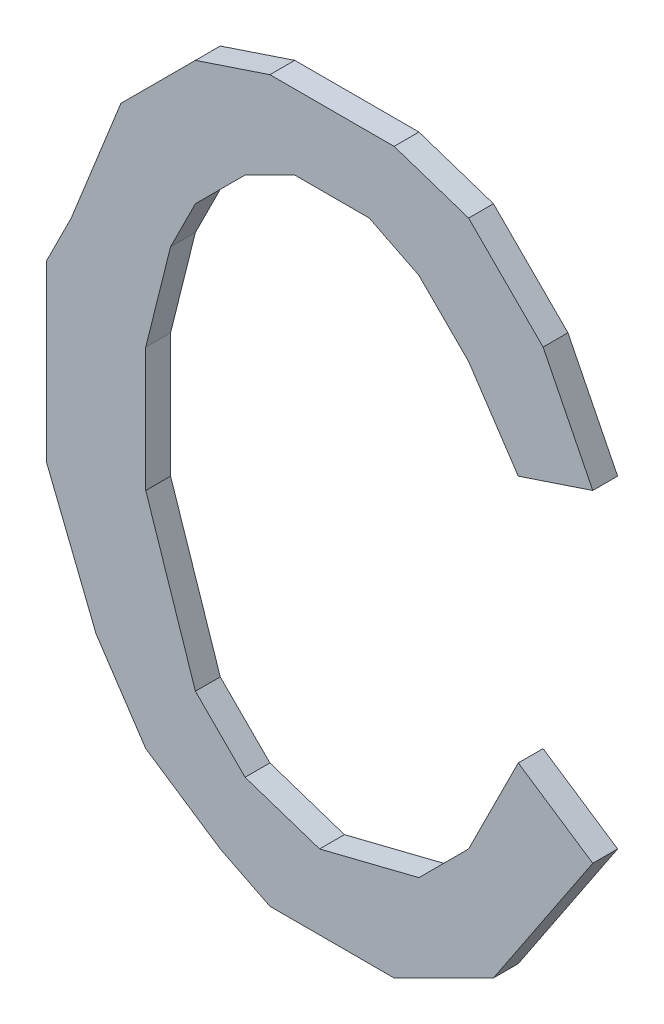
ISO-10303-21;
HEADER;
FILE_DESCRIPTION(('STEP AP214'),'2;1');
FILE_NAME('part.step','',(''),(''),'','','');
FILE_SCHEMA(('AUTOMOTIVE_DESIGN { 1 0 10303 214 1 1 1 1 }'));
ENDSEC;
DATA;
#1=APPLICATION_CONTEXT('core data for automotive mechanical design processes');
#2=APPLICATION_PROTOCOL_DEFINITION('international standard','automotive_design',2000,#1);
#3=PRODUCT_CONTEXT('',#1,'mechanical');
#4=PRODUCT('Part','Part','',(#3));
#5=PRODUCT_RELATED_PRODUCT_CATEGORY('part','',(#4));
#6=PRODUCT_DEFINITION_FORMATION('','',#4);
#7=PRODUCT_DEFINITION_CONTEXT('part definition',#1,'design');
#8=PRODUCT_DEFINITION('design','',#6,#7);
#9=PRODUCT_DEFINITION_SHAPE('','',#8);
#10=(LENGTH_UNIT() NAMED_UNIT(*) SI_UNIT(.MILLI.,.METRE.));
#11=(NAMED_UNIT(*) PLANE_ANGLE_UNIT() SI_UNIT($,.RADIAN.));
#12=(NAMED_UNIT(*) SI_UNIT($,.STERADIAN.) SOLID_ANGLE_UNIT());
#13=UNCERTAINTY_MEASURE_WITH_UNIT(LENGTH_MEASURE(1.E-05),#10,'distance_accuracy_value','');
#14=(GEOMETRIC_REPRESENTATION_CONTEXT(3) GLOBAL_UNCERTAINTY_ASSIGNED_CONTEXT((#13)) GLOBAL_UNIT_ASSIGNED_CONTEXT((#10,
#11,#12)) REPRESENTATION_CONTEXT('',''));
#15=CARTESIAN_POINT('',(0.,0.,0.));
#16=DIRECTION('',(0.,0.,1.));
#17=DIRECTION('',(1.,0.,0.));
#18=AXIS2_PLACEMENT_3D('',#15,#16,#17);
#19=CARTESIAN_POINT('',(-0.06999732,0.02500122000001,0.));
#20=DIRECTION('',(0.,0.,1.));
#21=DIRECTION('',(1.,0.,0.));
#22=AXIS2_PLACEMENT_3D('',#19,#20,#21);
#23=PLANE('',#22);
#24=DIRECTION('',(0.316227766016838,-0.948683298050514,0.));
#25=VECTOR('',#24,1.);
#26=CARTESIAN_POINT('',(-0.04999736000001,-0.08499855999999,0.));
#27=LINE('',#26,#25);
#28=CARTESIAN_POINT('',(-0.069997320000003,-0.024998680000001,0.));
#29=VERTEX_POINT('',#28);
#30=CARTESIAN_POINT('',(-0.04999736000001,-0.08499855999999,0.));
#31=VERTEX_POINT('',#30);
#32=EDGE_CURVE('E462',#29,#31,#27,.T.);
#33=ORIENTED_EDGE('',*,*,#32,.T.);
#34=DIRECTION('',(0.707106781186548,-0.707106781186548,0.));
#35=VECTOR('',#34,1.);
#36=CARTESIAN_POINT('',(-0.0299974,-0.10499852,0.));
#37=LINE('',#36,#35);
#38=CARTESIAN_POINT('',(-0.0299973999999986,-0.104998519999996,0.));
#39=VERTEX_POINT('',#38);
#40=EDGE_CURVE('E455',#31,#39,#37,.T.);
#41=ORIENTED_EDGE('',*,*,#40,.T.);
#42=DIRECTION('',(0.948683298050414,-0.316227766017138,0.));
#43=VECTOR('',#42,1.);
#44=CARTESIAN_POINT('',(2.539999996998E-06,-0.1149985,0.));
#45=LINE('',#44,#43);
#46=CARTESIAN_POINT('',(2.53999999587647E-06,-0.114998499999995,0.));
#47=VERTEX_POINT('',#46);
#48=EDGE_CURVE('E448',#39,#47,#45,.T.);
#49=ORIENTED_EDGE('',*,*,#48,.T.);
#50=DIRECTION('',(0.970142500145391,0.242535625036098,0.));
#51=VECTOR('',#50,1.);
#52=CARTESIAN_POINT('',(0.04000246,-0.10499852,0.));
#53=LINE('',#52,#51);
#54=CARTESIAN_POINT('',(0.0400024600000021,-0.104998520000002,0.));
#55=VERTEX_POINT('',#54);
#56=EDGE_CURVE('E441',#47,#55,#53,.T.);
#57=ORIENTED_EDGE('',*,*,#56,.T.);
#58=DIRECTION('',(0.707106781186048,0.707106781187048,0.));
#59=VECTOR('',#58,1.);
#60=CARTESIAN_POINT('',(0.06000241999999,-0.08499855999999,0.));
#61=LINE('',#60,#59);
#62=CARTESIAN_POINT('',(0.060002419999994,-0.084998559999992,0.));
#63=VERTEX_POINT('',#62);
#64=EDGE_CURVE('E434',#55,#63,#61,.T.);
#65=ORIENTED_EDGE('',*,*,#64,.T.);
#66=DIRECTION('',(0.447213595499958,0.894427190999916,0.));
#67=VECTOR('',#66,1.);
#68=CARTESIAN_POINT('',(0.08000238,-0.04499863999999,0.));
#69=LINE('',#68,#67);
#70=CARTESIAN_POINT('',(0.0800023799999949,-0.0449986399999976,0.));
#71=VERTEX_POINT('',#70);
#72=EDGE_CURVE('E427',#63,#71,#69,.T.);
#73=ORIENTED_EDGE('',*,*,#72,.T.);
#74=DIRECTION('',(0.832050294337998,-0.554700196224998,0.));
#75=VECTOR('',#74,1.);
#76=CARTESIAN_POINT('',(0.11000232,-0.0649986,0.));
#77=LINE('',#76,#75);
#78=CARTESIAN_POINT('',(0.110002319999988,-0.0649985999999921,0.));
#79=VERTEX_POINT('',#78);
#80=EDGE_CURVE('E420',#71,#79,#77,.T.);
#81=ORIENTED_EDGE('',*,*,#80,.T.);
#82=DIRECTION('',(-0.554700196224998,-0.832050294337998,0.));
#83=VECTOR('',#82,1.);
#84=CARTESIAN_POINT('',(0.07000239999999,-0.12499848,0.));
#85=LINE('',#84,#83);
#86=CARTESIAN_POINT('',(0.07000239999999,-0.12499848,0.));
#87=VERTEX_POINT('',#86);
#88=EDGE_CURVE('E413',#79,#87,#85,.T.);
#89=ORIENTED_EDGE('',*,*,#88,.T.);
#90=DIRECTION('',(-0.894427190999916,-0.447213595499958,0.));
#91=VECTOR('',#90,1.);
#92=CARTESIAN_POINT('',(0.03000247999999,-0.14499844,0.));
#93=LINE('',#92,#91);
#94=CARTESIAN_POINT('',(0.0300024799999901,-0.14499844,0.));
#95=VERTEX_POINT('',#94);
#96=EDGE_CURVE('E406',#87,#95,#93,.T.);
#97=ORIENTED_EDGE('',*,*,#96,.T.);
#98=DIRECTION('',(1.,0.,0.));
#99=VECTOR('',#98,1.);
#100=CARTESIAN_POINT('',(-0.01999742000001,-0.14499844,0.));
#101=LINE('',#100,#99);
#102=CARTESIAN_POINT('',(-0.019997420000009,-0.144998439999998,0.));
#103=VERTEX_POINT('',#102);
#104=EDGE_CURVE('E399',#95,#103,#101,.F.);
#105=ORIENTED_EDGE('',*,*,#104,.T.);
#106=DIRECTION('',(-0.894427190999916,0.447213595499958,0.));
#107=VECTOR('',#106,1.);
#108=CARTESIAN_POINT('',(-0.03999738,-0.13499846,0.));
#109=LINE('',#108,#107);
#110=CARTESIAN_POINT('',(-0.0399973799999972,-0.134998459999996,0.));
#111=VERTEX_POINT('',#110);
#112=EDGE_CURVE('E392',#103,#111,#109,.T.);
#113=ORIENTED_EDGE('',*,*,#112,.T.);
#114=DIRECTION('',(-0.832050294337998,0.554700196224998,0.));
#115=VECTOR('',#114,1.);
#116=CARTESIAN_POINT('',(-0.06999732,-0.1149985,0.));
#117=LINE('',#116,#115);
#118=CARTESIAN_POINT('',(-0.0699973200000011,-0.1149985,0.));
#119=VERTEX_POINT('',#118);
#120=EDGE_CURVE('E385',#111,#119,#117,.T.);
#121=ORIENTED_EDGE('',*,*,#120,.T.);
#122=DIRECTION('',(-0.554748964411929,0.832017780148894,0.));
#123=VECTOR('',#122,1.);
#124=CARTESIAN_POINT('',(-0.08999982,-0.08499855999999,0.));
#125=LINE('',#124,#123);
#126=CARTESIAN_POINT('',(-0.0899998200000017,-0.0849985599999907,0.));
#127=VERTEX_POINT('',#126);
#128=EDGE_CURVE('E378',#119,#127,#125,.T.);
#129=ORIENTED_EDGE('',*,*,#128,.T.);
#130=DIRECTION('',(-0.371390676354104,0.928476690885259,0.));
#131=VECTOR('',#130,1.);
#132=CARTESIAN_POINT('',(-0.10999978,-0.03499866,0.));
#133=LINE('',#132,#131);
#134=CARTESIAN_POINT('',(-0.10999978,-0.03499866,0.));
#135=VERTEX_POINT('',#134);
#136=EDGE_CURVE('E371',#127,#135,#133,.T.);
#137=ORIENTED_EDGE('',*,*,#136,.T.);
#138=DIRECTION('',(0.,1.,0.));
#139=VECTOR('',#138,1.);
#140=CARTESIAN_POINT('',(-0.10999978,0.03500120000001,0.));
#141=LINE('',#140,#139);
#142=CARTESIAN_POINT('',(-0.109999780000002,0.035001200000011,0.));
#143=VERTEX_POINT('',#142);
#144=EDGE_CURVE('E364',#135,#143,#141,.T.);
#145=ORIENTED_EDGE('',*,*,#144,.T.);
#146=DIRECTION('',(0.447213595499958,0.894427190999916,0.));
#147=VECTOR('',#146,1.);
#148=CARTESIAN_POINT('',(-0.09999980000001,0.05500116,0.));
#149=LINE('',#148,#147);
#150=CARTESIAN_POINT('',(-0.0999998000000056,0.0550011599999985,0.));
#151=VERTEX_POINT('',#150);
#152=EDGE_CURVE('E357',#143,#151,#149,.T.);
#153=ORIENTED_EDGE('',*,*,#152,.T.);
#154=DIRECTION('',(0.371390676354104,0.928476690885259,0.));
#155=VECTOR('',#154,1.);
#156=CARTESIAN_POINT('',(-0.07999984,0.10500106,0.));
#157=LINE('',#156,#155);
#158=CARTESIAN_POINT('',(-0.0799998400000079,0.105001060000008,0.));
#159=VERTEX_POINT('',#158);
#160=EDGE_CURVE('E350',#151,#159,#157,.T.);
#161=ORIENTED_EDGE('',*,*,#160,.T.);
#162=DIRECTION('',(0.707136713532992,0.707076847572992,0.));
#163=VECTOR('',#162,1.);
#164=CARTESIAN_POINT('',(-0.04999736000001,0.135001,0.));
#165=LINE('',#164,#163);
#166=CARTESIAN_POINT('',(-0.0499973600000084,0.135000999999995,0.));
#167=VERTEX_POINT('',#166);
#168=EDGE_CURVE('E343',#159,#167,#165,.T.);
#169=ORIENTED_EDGE('',*,*,#168,.T.);
#170=DIRECTION('',(0.948683298050414,0.316227766017138,0.));
#171=VECTOR('',#170,1.);
#172=CARTESIAN_POINT('',(-0.01999742000001,0.14500098,0.));
#173=LINE('',#172,#171);
#174=CARTESIAN_POINT('',(-0.01999742000001,0.14500098,0.));
#175=VERTEX_POINT('',#174);
#176=EDGE_CURVE('E336',#167,#175,#173,.T.);
#177=ORIENTED_EDGE('',*,*,#176,.T.);
#178=DIRECTION('',(1.,0.,0.));
#179=VECTOR('',#178,1.);
#180=CARTESIAN_POINT('',(0.03000247999999,0.14500098,0.));
#181=LINE('',#180,#179);
#182=CARTESIAN_POINT('',(0.0300024799999916,0.145000980000005,0.));
#183=VERTEX_POINT('',#182);
#184=EDGE_CURVE('E329',#175,#183,#181,.T.);
#185=ORIENTED_EDGE('',*,*,#184,.T.);
#186=DIRECTION('',(0.948683298050414,-0.316227766017138,0.));
#187=VECTOR('',#186,1.);
#188=CARTESIAN_POINT('',(0.06000241999999,0.135001,0.));
#189=LINE('',#188,#187);
#190=CARTESIAN_POINT('',(0.0600024199999819,0.135000999999992,0.));
#191=VERTEX_POINT('',#190);
#192=EDGE_CURVE('E322',#183,#191,#189,.T.);
#193=ORIENTED_EDGE('',*,*,#192,.T.);
#194=DIRECTION('',(0.707106781187048,-0.707106781186048,0.));
#195=VECTOR('',#194,1.);
#196=CARTESIAN_POINT('',(0.09000236,0.10500106,0.));
#197=LINE('',#196,#195);
#198=CARTESIAN_POINT('',(0.090002360000002,0.105001060000001,0.));
#199=VERTEX_POINT('',#198);
#200=EDGE_CURVE('E315',#191,#199,#197,.T.);
#201=ORIENTED_EDGE('',*,*,#200,.T.);
#202=DIRECTION('',(0.447213595499958,-0.894427190999916,0.));
#203=VECTOR('',#202,1.);
#204=CARTESIAN_POINT('',(0.11000232,0.06500114000001,0.));
#205=LINE('',#204,#203);
#206=CARTESIAN_POINT('',(0.11000232,0.0650011400000103,0.));
#207=VERTEX_POINT('',#206);
#208=EDGE_CURVE('E308',#199,#207,#205,.T.);
#209=ORIENTED_EDGE('',*,*,#208,.T.);
#210=DIRECTION('',(-0.948683298050414,-0.316227766017138,0.));
#211=VECTOR('',#210,1.);
#212=CARTESIAN_POINT('',(0.08000238,0.05500116,0.));
#213=LINE('',#212,#211);
#214=CARTESIAN_POINT('',(0.0800023799999924,0.0550011599999949,0.));
#215=VERTEX_POINT('',#214);
#216=EDGE_CURVE('E301',#207,#215,#213,.T.);
#217=ORIENTED_EDGE('',*,*,#216,.T.);
#218=DIRECTION('',(-0.554700196224998,0.832050294337998,0.));
#219=VECTOR('',#218,1.);
#220=CARTESIAN_POINT('',(0.06000241999999,0.0850011,0.));
#221=LINE('',#220,#219);
#222=CARTESIAN_POINT('',(0.0600024199999854,0.0850010999999955,0.));
#223=VERTEX_POINT('',#222);
#224=EDGE_CURVE('E294',#215,#223,#221,.T.);
#225=ORIENTED_EDGE('',*,*,#224,.T.);
#226=DIRECTION('',(-0.707106781186048,0.707106781187048,0.));
#227=VECTOR('',#226,1.);
#228=CARTESIAN_POINT('',(0.04000246,0.10500106,0.));
#229=LINE('',#228,#227);
#230=CARTESIAN_POINT('',(0.040002459999999,0.105001059999998,0.));
#231=VERTEX_POINT('',#230);
#232=EDGE_CURVE('E287',#223,#231,#229,.T.);
#233=ORIENTED_EDGE('',*,*,#232,.T.);
#234=DIRECTION('',(-0.894427190999916,0.447213595499958,0.));
#235=VECTOR('',#234,1.);
#236=CARTESIAN_POINT('',(0.02000249999999,0.11500104,0.));
#237=LINE('',#236,#235);
#238=CARTESIAN_POINT('',(0.02000249999999,0.11500104,0.));
#239=VERTEX_POINT('',#238);
#240=EDGE_CURVE('E280',#231,#239,#237,.T.);
#241=ORIENTED_EDGE('',*,*,#240,.T.);
#242=DIRECTION('',(1.,0.,0.));
#243=VECTOR('',#242,1.);
#244=CARTESIAN_POINT('',(-0.009997440000006,0.11500104,0.));
#245=LINE('',#244,#243);
#246=CARTESIAN_POINT('',(-0.0099974400000054,0.115001039999999,0.));
#247=VERTEX_POINT('',#246);
#248=EDGE_CURVE('E273',#239,#247,#245,.F.);
#249=ORIENTED_EDGE('',*,*,#248,.T.);
#250=DIRECTION('',(-0.894427190999916,-0.447213595499958,0.));
#251=VECTOR('',#250,1.);
#252=CARTESIAN_POINT('',(-0.0299974,0.10500106,0.));
#253=LINE('',#252,#251);
#254=CARTESIAN_POINT('',(-0.0299974000000025,0.105001060000002,0.));
#255=VERTEX_POINT('',#254);
#256=EDGE_CURVE('E267',#247,#255,#253,.T.);
#257=ORIENTED_EDGE('',*,*,#256,.T.);
#258=DIRECTION('',(-0.707106781186548,-0.707106781186548,0.));
#259=VECTOR('',#258,1.);
#260=CARTESIAN_POINT('',(-0.04999736000001,0.0850011,0.));
#261=LINE('',#260,#259);
#262=CARTESIAN_POINT('',(-0.049997360000012,0.085001100000001,0.));
#263=VERTEX_POINT('',#262);
#264=EDGE_CURVE('E245',#255,#263,#261,.T.);
#265=ORIENTED_EDGE('',*,*,#264,.T.);
#266=DIRECTION('',(-0.447213595499958,-0.894427190999916,0.));
#267=VECTOR('',#266,1.);
#268=CARTESIAN_POINT('',(-0.05999734000001,0.06500114000001,0.));
#269=LINE('',#268,#267);
#270=CARTESIAN_POINT('',(-0.0599973400000101,0.0650011400000101,0.));
#271=VERTEX_POINT('',#270);
#272=EDGE_CURVE('E229',#263,#271,#269,.T.);
#273=ORIENTED_EDGE('',*,*,#272,.T.);
#274=DIRECTION('',(-0.242535625036098,-0.970142500145391,0.));
#275=VECTOR('',#274,1.);
#276=CARTESIAN_POINT('',(-0.06999732,0.02500122000001,0.));
#277=LINE('',#276,#275);
#278=CARTESIAN_POINT('',(-0.06999732,0.02500122000001,0.));
#279=VERTEX_POINT('',#278);
#280=EDGE_CURVE('E19',#271,#279,#277,.T.);
#281=ORIENTED_EDGE('',*,*,#280,.T.);
#282=DIRECTION('',(0.,1.,0.));
#283=VECTOR('',#282,1.);
#284=CARTESIAN_POINT('',(-0.06999732,-0.02499868,0.));
#285=LINE('',#284,#283);
#286=EDGE_CURVE('E468',#279,#29,#285,.F.);
#287=ORIENTED_EDGE('',*,*,#286,.T.);
#288=EDGE_LOOP('',(#33,#41,#49,#57,#65,#73,#81,#89,#97,#105,#113,#121,#129,#137,#145,#153,#161,
#169,#177,#185,#193,#201,#209,#217,#225,#233,#241,#249,#257,#265,#273,#281,#287));
#289=FACE_BOUND('',#288,.T.);
#290=ADVANCED_FACE('F16',(#289),#23,.F.);
#291=CARTESIAN_POINT('',(-0.06999732,0.02500122000001,0.));
#292=DIRECTION('',(-0.970142500145391,0.242535625036098,0.));
#293=DIRECTION('',(-0.242535625036098,-0.970142500145391,0.));
#294=AXIS2_PLACEMENT_3D('',#291,#292,#293);
#295=PLANE('',#294);
#296=DIRECTION('',(0.,0.,1.));
#297=VECTOR('',#296,1.);
#298=CARTESIAN_POINT('',(-0.05999734000001,0.06500114000001,0.));
#299=LINE('',#298,#297);
#300=CARTESIAN_POINT('',(-0.0599973400000101,0.0650011400000101,0.01));
#301=VERTEX_POINT('',#300);
#302=EDGE_CURVE('E235',#271,#301,#299,.T.);
#303=ORIENTED_EDGE('',*,*,#302,.T.);
#304=DIRECTION('',(0.242535625036105,0.970142500145389,0.));
#305=VECTOR('',#304,1.);
#306=CARTESIAN_POINT('',(-0.06999732,0.02500122000001,0.01));
#307=LINE('',#306,#305);
#308=CARTESIAN_POINT('',(-0.06999732,0.02500122000001,0.01));
#309=VERTEX_POINT('',#308);
#310=EDGE_CURVE('E471',#309,#301,#307,.T.);
#311=ORIENTED_EDGE('',*,*,#310,.F.);
#312=DIRECTION('',(0.,0.,1.));
#313=VECTOR('',#312,1.);
#314=CARTESIAN_POINT('',(-0.06999732,0.02500122000001,0.));
#315=LINE('',#314,#313);
#316=EDGE_CURVE('E238',#309,#279,#315,.F.);
#317=ORIENTED_EDGE('',*,*,#316,.T.);
#318=ORIENTED_EDGE('',*,*,#280,.F.);
#319=EDGE_LOOP('',(#303,#311,#317,#318));
#320=FACE_BOUND('',#319,.T.);
#321=ADVANCED_FACE('F234',(#320),#295,.F.);
#322=CARTESIAN_POINT('',(-0.05999734000001,0.06500114000001,0.));
#323=DIRECTION('',(-0.894427190999916,0.447213595499958,0.));
#324=DIRECTION('',(-0.447213595499958,-0.894427190999916,0.));
#325=AXIS2_PLACEMENT_3D('',#322,#323,#324);
#326=PLANE('',#325);
#327=DIRECTION('',(0.,0.,1.));
#328=VECTOR('',#327,1.);
#329=CARTESIAN_POINT('',(-0.04999736000001,0.0850011,0.));
#330=LINE('',#329,#328);
#331=CARTESIAN_POINT('',(-0.049997360000012,0.085001100000001,0.01));
#332=VERTEX_POINT('',#331);
#333=EDGE_CURVE('E248',#263,#332,#330,.T.);
#334=ORIENTED_EDGE('',*,*,#333,.T.);
#335=DIRECTION('',(0.447213595500137,0.894427190999826,0.));
#336=VECTOR('',#335,1.);
#337=CARTESIAN_POINT('',(-0.05999734000001,0.06500114000001,0.01));
#338=LINE('',#337,#336);
#339=EDGE_CURVE('E252',#301,#332,#338,.T.);
#340=ORIENTED_EDGE('',*,*,#339,.F.);
#341=ORIENTED_EDGE('',*,*,#302,.F.);
#342=ORIENTED_EDGE('',*,*,#272,.F.);
#343=EDGE_LOOP('',(#334,#340,#341,#342));
#344=FACE_BOUND('',#343,.T.);
#345=ADVANCED_FACE('F250',(#344),#326,.F.);
#346=CARTESIAN_POINT('',(-0.04999736000001,0.0850011,0.));
#347=DIRECTION('',(-0.707106781186548,0.707106781186548,0.));
#348=DIRECTION('',(-0.707106781186548,-0.707106781186548,0.));
#349=AXIS2_PLACEMENT_3D('',#346,#347,#348);
#350=PLANE('',#349);
#351=DIRECTION('',(0.,0.,1.));
#352=VECTOR('',#351,1.);
#353=CARTESIAN_POINT('',(-0.0299974,0.10500106,0.));
#354=LINE('',#353,#352);
#355=CARTESIAN_POINT('',(-0.0299974000000025,0.105001060000002,0.01));
#356=VERTEX_POINT('',#355);
#357=EDGE_CURVE('E264',#255,#356,#354,.T.);
#358=ORIENTED_EDGE('',*,*,#357,.T.);
#359=DIRECTION('',(0.707106781186724,0.707106781186371,0.));
#360=VECTOR('',#359,1.);
#361=CARTESIAN_POINT('',(-0.04999736000001,0.0850011,0.01));
#362=LINE('',#361,#360);
#363=EDGE_CURVE('E476',#332,#356,#362,.T.);
#364=ORIENTED_EDGE('',*,*,#363,.F.);
#365=ORIENTED_EDGE('',*,*,#333,.F.);
#366=ORIENTED_EDGE('',*,*,#264,.F.);
#367=EDGE_LOOP('',(#358,#364,#365,#366));
#368=FACE_BOUND('',#367,.T.);
#369=ADVANCED_FACE('F724',(#368),#350,.F.);
#370=CARTESIAN_POINT('',(-0.0299974,0.10500106,0.));
#371=DIRECTION('',(-0.447213595499958,0.894427190999916,0.));
#372=DIRECTION('',(-0.894427190999916,-0.447213595499958,0.));
#373=AXIS2_PLACEMENT_3D('',#370,#371,#372);
#374=PLANE('',#373);
#375=DIRECTION('',(0.,0.,1.));
#376=VECTOR('',#375,1.);
#377=CARTESIAN_POINT('',(-0.009997440000006,0.11500104,0.));
#378=LINE('',#377,#376);
#379=CARTESIAN_POINT('',(-0.00999744000000541,0.115001039999999,0.01));
#380=VERTEX_POINT('',#379);
#381=EDGE_CURVE('E270',#247,#380,#378,.T.);
#382=ORIENTED_EDGE('',*,*,#381,.T.);
#383=DIRECTION('',(0.894427190999862,0.447213595500065,0.));
#384=VECTOR('',#383,1.);
#385=CARTESIAN_POINT('',(-0.0299974,0.10500106,0.01));
#386=LINE('',#385,#384);
#387=EDGE_CURVE('E480',#356,#380,#386,.T.);
#388=ORIENTED_EDGE('',*,*,#387,.F.);
#389=ORIENTED_EDGE('',*,*,#357,.F.);
#390=ORIENTED_EDGE('',*,*,#256,.F.);
#391=EDGE_LOOP('',(#382,#388,#389,#390));
#392=FACE_BOUND('',#391,.T.);
#393=ADVANCED_FACE('F720',(#392),#374,.F.);
#394=CARTESIAN_POINT('',(-0.009997440000006,0.11500104,0.));
#395=DIRECTION('',(0.,1.,0.));
#396=DIRECTION('',(0.,0.,1.));
#397=AXIS2_PLACEMENT_3D('',#394,#395,#396);
#398=PLANE('',#397);
#399=DIRECTION('',(0.,0.,1.));
#400=VECTOR('',#399,1.);
#401=CARTESIAN_POINT('',(0.02000249999999,0.11500104,0.));
#402=LINE('',#401,#400);
#403=CARTESIAN_POINT('',(0.02000249999999,0.11500104,0.01));
#404=VERTEX_POINT('',#403);
#405=EDGE_CURVE('E277',#239,#404,#402,.T.);
#406=ORIENTED_EDGE('',*,*,#405,.T.);
#407=DIRECTION('',(1.,0.,0.));
#408=VECTOR('',#407,1.);
#409=CARTESIAN_POINT('',(-0.06999732,0.11500104,0.01));
#410=LINE('',#409,#408);
#411=EDGE_CURVE('E484',#380,#404,#410,.T.);
#412=ORIENTED_EDGE('',*,*,#411,.F.);
#413=ORIENTED_EDGE('',*,*,#381,.F.);
#414=ORIENTED_EDGE('',*,*,#248,.F.);
#415=EDGE_LOOP('',(#406,#412,#413,#414));
#416=FACE_BOUND('',#415,.T.);
#417=ADVANCED_FACE('F716',(#416),#398,.F.);
#418=CARTESIAN_POINT('',(0.02000249999999,0.11500104,0.));
#419=DIRECTION('',(0.447213595499958,0.894427190999916,0.));
#420=DIRECTION('',(-0.894427190999916,0.447213595499958,0.));
#421=AXIS2_PLACEMENT_3D('',#418,#419,#420);
#422=PLANE('',#421);
#423=DIRECTION('',(0.,0.,1.));
#424=VECTOR('',#423,1.);
#425=CARTESIAN_POINT('',(0.04000246,0.10500106,0.));
#426=LINE('',#425,#424);
#427=CARTESIAN_POINT('',(0.040002459999999,0.105001059999998,0.01));
#428=VERTEX_POINT('',#427);
#429=EDGE_CURVE('E284',#231,#428,#426,.T.);
#430=ORIENTED_EDGE('',*,*,#429,.T.);
#431=DIRECTION('',(0.894427191000005,-0.447213595499779,0.));
#432=VECTOR('',#431,1.);
#433=CARTESIAN_POINT('',(0.02000249999999,0.11500104,0.01));
#434=LINE('',#433,#432);
#435=EDGE_CURVE('E488',#404,#428,#434,.T.);
#436=ORIENTED_EDGE('',*,*,#435,.F.);
#437=ORIENTED_EDGE('',*,*,#405,.F.);
#438=ORIENTED_EDGE('',*,*,#240,.F.);
#439=EDGE_LOOP('',(#430,#436,#437,#438));
#440=FACE_BOUND('',#439,.T.);
#441=ADVANCED_FACE('F712',(#440),#422,.F.);
#442=CARTESIAN_POINT('',(0.04000246,0.10500106,0.));
#443=DIRECTION('',(0.707106781187048,0.707106781186048,0.));
#444=DIRECTION('',(-0.707106781186048,0.707106781187048,0.));
#445=AXIS2_PLACEMENT_3D('',#442,#443,#444);
#446=PLANE('',#445);
#447=DIRECTION('',(0.,0.,1.));
#448=VECTOR('',#447,1.);
#449=CARTESIAN_POINT('',(0.06000241999999,0.0850011,0.));
#450=LINE('',#449,#448);
#451=CARTESIAN_POINT('',(0.0600024199999854,0.0850010999999955,0.01));
#452=VERTEX_POINT('',#451);
#453=EDGE_CURVE('E291',#223,#452,#450,.T.);
#454=ORIENTED_EDGE('',*,*,#453,.T.);
#455=DIRECTION('',(0.707106781186371,-0.707106781186724,0.));
#456=VECTOR('',#455,1.);
#457=CARTESIAN_POINT('',(0.04000246,0.10500106,0.01));
#458=LINE('',#457,#456);
#459=EDGE_CURVE('E492',#428,#452,#458,.T.);
#460=ORIENTED_EDGE('',*,*,#459,.F.);
#461=ORIENTED_EDGE('',*,*,#429,.F.);
#462=ORIENTED_EDGE('',*,*,#232,.F.);
#463=EDGE_LOOP('',(#454,#460,#461,#462));
#464=FACE_BOUND('',#463,.T.);
#465=ADVANCED_FACE('F708',(#464),#446,.F.);
#466=CARTESIAN_POINT('',(0.06000241999999,0.0850011,0.));
#467=DIRECTION('',(0.832050294337998,0.554700196224998,0.));
#468=DIRECTION('',(-0.554700196224998,0.832050294337998,0.));
#469=AXIS2_PLACEMENT_3D('',#466,#467,#468);
#470=PLANE('',#469);
#471=DIRECTION('',(0.,0.,1.));
#472=VECTOR('',#471,1.);
#473=CARTESIAN_POINT('',(0.08000238,0.05500116,0.));
#474=LINE('',#473,#472);
#475=CARTESIAN_POINT('',(0.0800023799999924,0.0550011599999949,0.01));
#476=VERTEX_POINT('',#475);
#477=EDGE_CURVE('E298',#215,#476,#474,.T.);
#478=ORIENTED_EDGE('',*,*,#477,.T.);
#479=DIRECTION('',(0.554700196225421,-0.832050294337716,0.));
#480=VECTOR('',#479,1.);
#481=CARTESIAN_POINT('',(0.06000241999999,0.0850011,0.01));
#482=LINE('',#481,#480);
#483=EDGE_CURVE('E496',#452,#476,#482,.T.);
#484=ORIENTED_EDGE('',*,*,#483,.F.);
#485=ORIENTED_EDGE('',*,*,#453,.F.);
#486=ORIENTED_EDGE('',*,*,#224,.F.);
#487=EDGE_LOOP('',(#478,#484,#485,#486));
#488=FACE_BOUND('',#487,.T.);
#489=ADVANCED_FACE('F704',(#488),#470,.F.);
#490=CARTESIAN_POINT('',(0.08000238,0.05500116,0.));
#491=DIRECTION('',(-0.316227766017138,0.948683298050414,0.));
#492=DIRECTION('',(-0.948683298050414,-0.316227766017138,0.));
#493=AXIS2_PLACEMENT_3D('',#490,#491,#492);
#494=PLANE('',#493);
#495=DIRECTION('',(0.,0.,1.));
#496=VECTOR('',#495,1.);
#497=CARTESIAN_POINT('',(0.11000232,0.06500114000001,0.));
#498=LINE('',#497,#496);
#499=CARTESIAN_POINT('',(0.11000232,0.0650011400000103,0.01));
#500=VERTEX_POINT('',#499);
#501=EDGE_CURVE('E305',#207,#500,#498,.T.);
#502=ORIENTED_EDGE('',*,*,#501,.T.);
#503=DIRECTION('',(0.948683298050419,0.316227766017123,0.));
#504=VECTOR('',#503,1.);
#505=CARTESIAN_POINT('',(0.08000238,0.05500116,0.01));
#506=LINE('',#505,#504);
#507=EDGE_CURVE('E500',#476,#500,#506,.T.);
#508=ORIENTED_EDGE('',*,*,#507,.F.);
#509=ORIENTED_EDGE('',*,*,#477,.F.);
#510=ORIENTED_EDGE('',*,*,#216,.F.);
#511=EDGE_LOOP('',(#502,#508,#509,#510));
#512=FACE_BOUND('',#511,.T.);
#513=ADVANCED_FACE('F700',(#512),#494,.F.);
#514=CARTESIAN_POINT('',(0.11000232,0.06500114000001,0.));
#515=DIRECTION('',(-0.894427190999916,-0.447213595499958,0.));
#516=DIRECTION('',(0.447213595499958,-0.894427190999916,0.));
#517=AXIS2_PLACEMENT_3D('',#514,#515,#516);
#518=PLANE('',#517);
#519=DIRECTION('',(0.,0.,1.));
#520=VECTOR('',#519,1.);
#521=CARTESIAN_POINT('',(0.09000236,0.10500106,0.));
#522=LINE('',#521,#520);
#523=CARTESIAN_POINT('',(0.090002360000002,0.105001060000001,0.01));
#524=VERTEX_POINT('',#523);
#525=EDGE_CURVE('E312',#199,#524,#522,.T.);
#526=ORIENTED_EDGE('',*,*,#525,.T.);
#527=DIRECTION('',(-0.447213595500048,0.894427190999871,0.));
#528=VECTOR('',#527,1.);
#529=CARTESIAN_POINT('',(0.11000232,0.06500114000001,0.01));
#530=LINE('',#529,#528);
#531=EDGE_CURVE('E504',#500,#524,#530,.T.);
#532=ORIENTED_EDGE('',*,*,#531,.F.);
#533=ORIENTED_EDGE('',*,*,#501,.F.);
#534=ORIENTED_EDGE('',*,*,#208,.F.);
#535=EDGE_LOOP('',(#526,#532,#533,#534));
#536=FACE_BOUND('',#535,.T.);
#537=ADVANCED_FACE('F696',(#536),#518,.F.);
#538=CARTESIAN_POINT('',(0.09000236,0.10500106,0.));
#539=DIRECTION('',(-0.707106781186048,-0.707106781187048,0.));
#540=DIRECTION('',(0.707106781187048,-0.707106781186048,0.));
#541=AXIS2_PLACEMENT_3D('',#538,#539,#540);
#542=PLANE('',#541);
#543=DIRECTION('',(0.,0.,1.));
#544=VECTOR('',#543,1.);
#545=CARTESIAN_POINT('',(0.06000241999999,0.135001,0.));
#546=LINE('',#545,#544);
#547=CARTESIAN_POINT('',(0.0600024199999819,0.135000999999992,0.01));
#548=VERTEX_POINT('',#547);
#549=EDGE_CURVE('E319',#191,#548,#546,.T.);
#550=ORIENTED_EDGE('',*,*,#549,.T.);
#551=DIRECTION('',(-0.707106781186665,0.70710678118643,0.));
#552=VECTOR('',#551,1.);
#553=CARTESIAN_POINT('',(0.09000236,0.10500106,0.01));
#554=LINE('',#553,#552);
#555=EDGE_CURVE('E508',#524,#548,#554,.T.);
#556=ORIENTED_EDGE('',*,*,#555,.F.);
#557=ORIENTED_EDGE('',*,*,#525,.F.);
#558=ORIENTED_EDGE('',*,*,#200,.F.);
#559=EDGE_LOOP('',(#550,#556,#557,#558));
#560=FACE_BOUND('',#559,.T.);
#561=ADVANCED_FACE('F692',(#560),#542,.F.);
#562=CARTESIAN_POINT('',(0.06000241999999,0.135001,0.));
#563=DIRECTION('',(-0.316227766017138,-0.948683298050414,0.));
#564=DIRECTION('',(0.948683298050414,-0.316227766017138,0.));
#565=AXIS2_PLACEMENT_3D('',#562,#563,#564);
#566=PLANE('',#565);
#567=DIRECTION('',(0.,0.,-1.));
#568=VECTOR('',#567,1.);
#569=CARTESIAN_POINT('',(0.03000247999999,0.14500098,0.));
#570=LINE('',#569,#568);
#571=CARTESIAN_POINT('',(0.0300024799999916,0.145000980000005,0.01));
#572=VERTEX_POINT('',#571);
#573=EDGE_CURVE('E326',#183,#572,#570,.F.);
#574=ORIENTED_EDGE('',*,*,#573,.T.);
#575=DIRECTION('',(-0.948683298050514,0.316227766016837,0.));
#576=VECTOR('',#575,1.);
#577=CARTESIAN_POINT('',(0.06000241999999,0.135001,0.01));
#578=LINE('',#577,#576);
#579=EDGE_CURVE('E512',#548,#572,#578,.T.);
#580=ORIENTED_EDGE('',*,*,#579,.F.);
#581=ORIENTED_EDGE('',*,*,#549,.F.);
#582=ORIENTED_EDGE('',*,*,#192,.F.);
#583=EDGE_LOOP('',(#574,#580,#581,#582));
#584=FACE_BOUND('',#583,.T.);
#585=ADVANCED_FACE('F688',(#584),#566,.F.);
#586=CARTESIAN_POINT('',(0.03000247999999,0.14500098,0.));
#587=DIRECTION('',(0.,-1.,0.));
#588=DIRECTION('',(0.,0.,-1.));
#589=AXIS2_PLACEMENT_3D('',#586,#587,#588);
#590=PLANE('',#589);
#591=DIRECTION('',(0.,0.,1.));
#592=VECTOR('',#591,1.);
#593=CARTESIAN_POINT('',(-0.01999742000001,0.14500098,0.));
#594=LINE('',#593,#592);
#595=CARTESIAN_POINT('',(-0.01999742000001,0.14500098,0.01));
#596=VERTEX_POINT('',#595);
#597=EDGE_CURVE('E333',#175,#596,#594,.T.);
#598=ORIENTED_EDGE('',*,*,#597,.T.);
#599=DIRECTION('',(1.,0.,0.));
#600=VECTOR('',#599,1.);
#601=CARTESIAN_POINT('',(-0.06999732,0.14500098,0.01));
#602=LINE('',#601,#600);
#603=EDGE_CURVE('E516',#572,#596,#602,.F.);
#604=ORIENTED_EDGE('',*,*,#603,.F.);
#605=ORIENTED_EDGE('',*,*,#573,.F.);
#606=ORIENTED_EDGE('',*,*,#184,.F.);
#607=EDGE_LOOP('',(#598,#604,#605,#606));
#608=FACE_BOUND('',#607,.T.);
#609=ADVANCED_FACE('F684',(#608),#590,.F.);
#610=CARTESIAN_POINT('',(-0.01999742000001,0.14500098,0.));
#611=DIRECTION('',(0.316227766017138,-0.948683298050414,0.));
#612=DIRECTION('',(0.948683298050414,0.316227766017138,0.));
#613=AXIS2_PLACEMENT_3D('',#610,#611,#612);
#614=PLANE('',#613);
#615=DIRECTION('',(0.,0.,1.));
#616=VECTOR('',#615,1.);
#617=CARTESIAN_POINT('',(-0.04999736000001,0.135001,0.));
#618=LINE('',#617,#616);
#619=CARTESIAN_POINT('',(-0.0499973600000084,0.135000999999995,0.01));
#620=VERTEX_POINT('',#619);
#621=EDGE_CURVE('E340',#167,#620,#618,.T.);
#622=ORIENTED_EDGE('',*,*,#621,.T.);
#623=DIRECTION('',(-0.948683298050514,-0.316227766016838,0.));
#624=VECTOR('',#623,1.);
#625=CARTESIAN_POINT('',(-0.01999742000001,0.14500098,0.01));
#626=LINE('',#625,#624);
#627=EDGE_CURVE('E520',#596,#620,#626,.T.);
#628=ORIENTED_EDGE('',*,*,#627,.F.);
#629=ORIENTED_EDGE('',*,*,#597,.F.);
#630=ORIENTED_EDGE('',*,*,#176,.F.);
#631=EDGE_LOOP('',(#622,#628,#629,#630));
#632=FACE_BOUND('',#631,.T.);
#633=ADVANCED_FACE('F680',(#632),#614,.F.);
#634=CARTESIAN_POINT('',(-0.04999736000001,0.135001,0.));
#635=DIRECTION('',(0.707076847572992,-0.707136713532992,0.));
#636=DIRECTION('',(0.707136713532992,0.707076847572992,0.));
#637=AXIS2_PLACEMENT_3D('',#634,#635,#636);
#638=PLANE('',#637);
#639=DIRECTION('',(0.,0.,1.));
#640=VECTOR('',#639,1.);
#641=CARTESIAN_POINT('',(-0.07999984,0.10500106,0.));
#642=LINE('',#641,#640);
#643=CARTESIAN_POINT('',(-0.0799998400000079,0.105001060000008,0.01));
#644=VERTEX_POINT('',#643);
#645=EDGE_CURVE('E347',#159,#644,#642,.T.);
#646=ORIENTED_EDGE('',*,*,#645,.T.);
#647=DIRECTION('',(-0.70713671353262,-0.707076847573363,0.));
#648=VECTOR('',#647,1.);
#649=CARTESIAN_POINT('',(-0.04999736000001,0.135001,0.01));
#650=LINE('',#649,#648);
#651=EDGE_CURVE('E524',#620,#644,#650,.T.);
#652=ORIENTED_EDGE('',*,*,#651,.F.);
#653=ORIENTED_EDGE('',*,*,#621,.F.);
#654=ORIENTED_EDGE('',*,*,#168,.F.);
#655=EDGE_LOOP('',(#646,#652,#653,#654));
#656=FACE_BOUND('',#655,.T.);
#657=ADVANCED_FACE('F676',(#656),#638,.F.);
#658=CARTESIAN_POINT('',(-0.07999984,0.10500106,0.));
#659=DIRECTION('',(0.928476690885259,-0.371390676354104,0.));
#660=DIRECTION('',(0.371390676354104,0.928476690885259,0.));
#661=AXIS2_PLACEMENT_3D('',#658,#659,#660);
#662=PLANE('',#661);
#663=DIRECTION('',(0.,0.,1.));
#664=VECTOR('',#663,1.);
#665=CARTESIAN_POINT('',(-0.09999980000001,0.05500116,0.));
#666=LINE('',#665,#664);
#667=CARTESIAN_POINT('',(-0.0999998000000056,0.0550011599999985,0.01));
#668=VERTEX_POINT('',#667);
#669=EDGE_CURVE('E354',#151,#668,#666,.T.);
#670=ORIENTED_EDGE('',*,*,#669,.T.);
#671=DIRECTION('',(-0.371390676354264,-0.928476690885195,0.));
#672=VECTOR('',#671,1.);
#673=CARTESIAN_POINT('',(-0.07999984,0.10500106,0.01));
#674=LINE('',#673,#672);
#675=EDGE_CURVE('E528',#644,#668,#674,.T.);
#676=ORIENTED_EDGE('',*,*,#675,.F.);
#677=ORIENTED_EDGE('',*,*,#645,.F.);
#678=ORIENTED_EDGE('',*,*,#160,.F.);
#679=EDGE_LOOP('',(#670,#676,#677,#678));
#680=FACE_BOUND('',#679,.T.);
#681=ADVANCED_FACE('F672',(#680),#662,.F.);
#682=CARTESIAN_POINT('',(-0.09999980000001,0.05500116,0.));
#683=DIRECTION('',(0.894427190999916,-0.447213595499958,0.));
#684=DIRECTION('',(0.447213595499958,0.894427190999916,0.));
#685=AXIS2_PLACEMENT_3D('',#682,#683,#684);
#686=PLANE('',#685);
#687=DIRECTION('',(0.,0.,-1.));
#688=VECTOR('',#687,1.);
#689=CARTESIAN_POINT('',(-0.10999978,0.03500120000001,0.));
#690=LINE('',#689,#688);
#691=CARTESIAN_POINT('',(-0.109999780000002,0.035001200000011,0.01));
#692=VERTEX_POINT('',#691);
#693=EDGE_CURVE('E361',#143,#692,#690,.F.);
#694=ORIENTED_EDGE('',*,*,#693,.T.);
#695=DIRECTION('',(-0.447213595499779,-0.894427191000006,0.));
#696=VECTOR('',#695,1.);
#697=CARTESIAN_POINT('',(-0.09999980000001,0.05500116,0.01));
#698=LINE('',#697,#696);
#699=EDGE_CURVE('E532',#668,#692,#698,.T.);
#700=ORIENTED_EDGE('',*,*,#699,.F.);
#701=ORIENTED_EDGE('',*,*,#669,.F.);
#702=ORIENTED_EDGE('',*,*,#152,.F.);
#703=EDGE_LOOP('',(#694,#700,#701,#702));
#704=FACE_BOUND('',#703,.T.);
#705=ADVANCED_FACE('F668',(#704),#686,.F.);
#706=CARTESIAN_POINT('',(-0.10999978,0.03500120000001,0.));
#707=DIRECTION('',(1.,0.,0.));
#708=DIRECTION('',(0.,0.,-1.));
#709=AXIS2_PLACEMENT_3D('',#706,#707,#708);
#710=PLANE('',#709);
#711=DIRECTION('',(0.,0.,1.));
#712=VECTOR('',#711,1.);
#713=CARTESIAN_POINT('',(-0.10999978,-0.03499866,0.));
#714=LINE('',#713,#712);
#715=CARTESIAN_POINT('',(-0.10999978,-0.03499866,0.01));
#716=VERTEX_POINT('',#715);
#717=EDGE_CURVE('E368',#135,#716,#714,.T.);
#718=ORIENTED_EDGE('',*,*,#717,.T.);
#719=DIRECTION('',(0.,1.,0.));
#720=VECTOR('',#719,1.);
#721=CARTESIAN_POINT('',(-0.10999978,0.02500122000001,0.01));
#722=LINE('',#721,#720);
#723=EDGE_CURVE('E536',#692,#716,#722,.F.);
#724=ORIENTED_EDGE('',*,*,#723,.F.);
#725=ORIENTED_EDGE('',*,*,#693,.F.);
#726=ORIENTED_EDGE('',*,*,#144,.F.);
#727=EDGE_LOOP('',(#718,#724,#725,#726));
#728=FACE_BOUND('',#727,.T.);
#729=ADVANCED_FACE('F664',(#728),#710,.F.);
#730=CARTESIAN_POINT('',(-0.10999978,-0.03499866,0.));
#731=DIRECTION('',(0.928476690885259,0.371390676354104,0.));
#732=DIRECTION('',(-0.371390676354104,0.928476690885259,0.));
#733=AXIS2_PLACEMENT_3D('',#730,#731,#732);
#734=PLANE('',#733);
#735=DIRECTION('',(0.,0.,1.));
#736=VECTOR('',#735,1.);
#737=CARTESIAN_POINT('',(-0.08999982,-0.08499855999999,0.));
#738=LINE('',#737,#736);
#739=CARTESIAN_POINT('',(-0.0899998200000017,-0.0849985599999907,0.01));
#740=VERTEX_POINT('',#739);
#741=EDGE_CURVE('E375',#127,#740,#738,.T.);
#742=ORIENTED_EDGE('',*,*,#741,.T.);
#743=DIRECTION('',(0.371390676354168,-0.928476690885234,0.));
#744=VECTOR('',#743,1.);
#745=CARTESIAN_POINT('',(-0.10999978,-0.03499866,0.01));
#746=LINE('',#745,#744);
#747=EDGE_CURVE('E540',#716,#740,#746,.T.);
#748=ORIENTED_EDGE('',*,*,#747,.F.);
#749=ORIENTED_EDGE('',*,*,#717,.F.);
#750=ORIENTED_EDGE('',*,*,#136,.F.);
#751=EDGE_LOOP('',(#742,#748,#749,#750));
#752=FACE_BOUND('',#751,.T.);
#753=ADVANCED_FACE('F660',(#752),#734,.F.);
#754=CARTESIAN_POINT('',(-0.08999982,-0.08499855999999,0.));
#755=DIRECTION('',(0.832017780148894,0.554748964411929,0.));
#756=DIRECTION('',(-0.554748964411929,0.832017780148894,0.));
#757=AXIS2_PLACEMENT_3D('',#754,#755,#756);
#758=PLANE('',#757);
#759=DIRECTION('',(0.,0.,1.));
#760=VECTOR('',#759,1.);
#761=CARTESIAN_POINT('',(-0.06999732,-0.1149985,0.));
#762=LINE('',#761,#760);
#763=CARTESIAN_POINT('',(-0.0699973200000011,-0.1149985,0.01));
#764=VERTEX_POINT('',#763);
#765=EDGE_CURVE('E382',#119,#764,#762,.T.);
#766=ORIENTED_EDGE('',*,*,#765,.T.);
#767=DIRECTION('',(0.554748964411991,-0.832017780148852,0.));
#768=VECTOR('',#767,1.);
#769=CARTESIAN_POINT('',(-0.08999982,-0.08499855999999,0.01));
#770=LINE('',#769,#768);
#771=EDGE_CURVE('E544',#740,#764,#770,.T.);
#772=ORIENTED_EDGE('',*,*,#771,.F.);
#773=ORIENTED_EDGE('',*,*,#741,.F.);
#774=ORIENTED_EDGE('',*,*,#128,.F.);
#775=EDGE_LOOP('',(#766,#772,#773,#774));
#776=FACE_BOUND('',#775,.T.);
#777=ADVANCED_FACE('F656',(#776),#758,.F.);
#778=CARTESIAN_POINT('',(-0.06999732,-0.1149985,0.));
#779=DIRECTION('',(0.554700196224998,0.832050294337998,0.));
#780=DIRECTION('',(-0.832050294337998,0.554700196224998,0.));
#781=AXIS2_PLACEMENT_3D('',#778,#779,#780);
#782=PLANE('',#781);
#783=DIRECTION('',(0.,0.,1.));
#784=VECTOR('',#783,1.);
#785=CARTESIAN_POINT('',(-0.03999738,-0.13499846,0.));
#786=LINE('',#785,#784);
#787=CARTESIAN_POINT('',(-0.0399973799999972,-0.134998459999996,0.01));
#788=VERTEX_POINT('',#787);
#789=EDGE_CURVE('E389',#111,#788,#786,.T.);
#790=ORIENTED_EDGE('',*,*,#789,.T.);
#791=DIRECTION('',(0.832050294337844,-0.554700196225229,0.));
#792=VECTOR('',#791,1.);
#793=CARTESIAN_POINT('',(-0.06999732,-0.1149985,0.01));
#794=LINE('',#793,#792);
#795=EDGE_CURVE('E548',#764,#788,#794,.T.);
#796=ORIENTED_EDGE('',*,*,#795,.F.);
#797=ORIENTED_EDGE('',*,*,#765,.F.);
#798=ORIENTED_EDGE('',*,*,#120,.F.);
#799=EDGE_LOOP('',(#790,#796,#797,#798));
#800=FACE_BOUND('',#799,.T.);
#801=ADVANCED_FACE('F652',(#800),#782,.F.);
#802=CARTESIAN_POINT('',(-0.03999738,-0.13499846,0.));
#803=DIRECTION('',(0.447213595499958,0.894427190999916,0.));
#804=DIRECTION('',(-0.894427190999916,0.447213595499958,0.));
#805=AXIS2_PLACEMENT_3D('',#802,#803,#804);
#806=PLANE('',#805);
#807=DIRECTION('',(0.,0.,1.));
#808=VECTOR('',#807,1.);
#809=CARTESIAN_POINT('',(-0.01999742000001,-0.14499844,0.));
#810=LINE('',#809,#808);
#811=CARTESIAN_POINT('',(-0.019997420000009,-0.144998439999998,0.01));
#812=VERTEX_POINT('',#811);
#813=EDGE_CURVE('E396',#103,#812,#810,.T.);
#814=ORIENTED_EDGE('',*,*,#813,.T.);
#815=DIRECTION('',(0.894427190999827,-0.447213595500137,0.));
#816=VECTOR('',#815,1.);
#817=CARTESIAN_POINT('',(-0.03999738,-0.13499846,0.01));
#818=LINE('',#817,#816);
#819=EDGE_CURVE('E552',#788,#812,#818,.T.);
#820=ORIENTED_EDGE('',*,*,#819,.F.);
#821=ORIENTED_EDGE('',*,*,#789,.F.);
#822=ORIENTED_EDGE('',*,*,#112,.F.);
#823=EDGE_LOOP('',(#814,#820,#821,#822));
#824=FACE_BOUND('',#823,.T.);
#825=ADVANCED_FACE('F648',(#824),#806,.F.);
#826=CARTESIAN_POINT('',(-0.01999742000001,-0.14499844,0.));
#827=DIRECTION('',(0.,1.,0.));
#828=DIRECTION('',(0.,0.,1.));
#829=AXIS2_PLACEMENT_3D('',#826,#827,#828);
#830=PLANE('',#829);
#831=DIRECTION('',(0.,0.,1.));
#832=VECTOR('',#831,1.);
#833=CARTESIAN_POINT('',(0.03000247999999,-0.14499844,0.));
#834=LINE('',#833,#832);
#835=CARTESIAN_POINT('',(0.0300024799999901,-0.14499844,0.01));
#836=VERTEX_POINT('',#835);
#837=EDGE_CURVE('E403',#95,#836,#834,.T.);
#838=ORIENTED_EDGE('',*,*,#837,.T.);
#839=DIRECTION('',(1.,0.,0.));
#840=VECTOR('',#839,1.);
#841=CARTESIAN_POINT('',(-0.06999732,-0.14499844,0.01));
#842=LINE('',#841,#840);
#843=EDGE_CURVE('E556',#812,#836,#842,.T.);
#844=ORIENTED_EDGE('',*,*,#843,.F.);
#845=ORIENTED_EDGE('',*,*,#813,.F.);
#846=ORIENTED_EDGE('',*,*,#104,.F.);
#847=EDGE_LOOP('',(#838,#844,#845,#846));
#848=FACE_BOUND('',#847,.T.);
#849=ADVANCED_FACE('F644',(#848),#830,.F.);
#850=CARTESIAN_POINT('',(0.03000247999999,-0.14499844,0.));
#851=DIRECTION('',(-0.447213595499958,0.894427190999916,0.));
#852=DIRECTION('',(-0.894427190999916,-0.447213595499958,0.));
#853=AXIS2_PLACEMENT_3D('',#850,#851,#852);
#854=PLANE('',#853);
#855=DIRECTION('',(0.,0.,1.));
#856=VECTOR('',#855,1.);
#857=CARTESIAN_POINT('',(0.07000239999999,-0.12499848,0.));
#858=LINE('',#857,#856);
#859=CARTESIAN_POINT('',(0.07000239999999,-0.12499848,0.01));
#860=VERTEX_POINT('',#859);
#861=EDGE_CURVE('E410',#87,#860,#858,.T.);
#862=ORIENTED_EDGE('',*,*,#861,.T.);
#863=DIRECTION('',(0.894427190999916,0.447213595499958,0.));
#864=VECTOR('',#863,1.);
#865=CARTESIAN_POINT('',(0.03000247999999,-0.14499844,0.01));
#866=LINE('',#865,#864);
#867=EDGE_CURVE('E560',#836,#860,#866,.T.);
#868=ORIENTED_EDGE('',*,*,#867,.F.);
#869=ORIENTED_EDGE('',*,*,#837,.F.);
#870=ORIENTED_EDGE('',*,*,#96,.F.);
#871=EDGE_LOOP('',(#862,#868,#869,#870));
#872=FACE_BOUND('',#871,.T.);
#873=ADVANCED_FACE('F640',(#872),#854,.F.);
#874=CARTESIAN_POINT('',(0.07000239999999,-0.12499848,0.));
#875=DIRECTION('',(-0.832050294337998,0.554700196224998,0.));
#876=DIRECTION('',(-0.554700196224998,-0.832050294337998,0.));
#877=AXIS2_PLACEMENT_3D('',#874,#875,#876);
#878=PLANE('',#877);
#879=DIRECTION('',(0.,0.,1.));
#880=VECTOR('',#879,1.);
#881=CARTESIAN_POINT('',(0.11000232,-0.0649986,0.));
#882=LINE('',#881,#880);
#883=CARTESIAN_POINT('',(0.110002319999988,-0.0649985999999921,0.01));
#884=VERTEX_POINT('',#883);
#885=EDGE_CURVE('E417',#79,#884,#882,.T.);
#886=ORIENTED_EDGE('',*,*,#885,.T.);
#887=DIRECTION('',(0.554700196225325,0.83205029433778,0.));
#888=VECTOR('',#887,1.);
#889=CARTESIAN_POINT('',(0.07000239999999,-0.12499848,0.01));
#890=LINE('',#889,#888);
#891=EDGE_CURVE('E564',#860,#884,#890,.T.);
#892=ORIENTED_EDGE('',*,*,#891,.F.);
#893=ORIENTED_EDGE('',*,*,#861,.F.);
#894=ORIENTED_EDGE('',*,*,#88,.F.);
#895=EDGE_LOOP('',(#886,#892,#893,#894));
#896=FACE_BOUND('',#895,.T.);
#897=ADVANCED_FACE('F636',(#896),#878,.F.);
#898=CARTESIAN_POINT('',(0.11000232,-0.0649986,0.));
#899=DIRECTION('',(-0.554700196224998,-0.832050294337998,0.));
#900=DIRECTION('',(0.832050294337998,-0.554700196224998,0.));
#901=AXIS2_PLACEMENT_3D('',#898,#899,#900);
#902=PLANE('',#901);
#903=DIRECTION('',(0.,0.,1.));
#904=VECTOR('',#903,1.);
#905=CARTESIAN_POINT('',(0.08000238,-0.04499863999999,0.));
#906=LINE('',#905,#904);
#907=CARTESIAN_POINT('',(0.0800023799999949,-0.0449986399999976,0.01));
#908=VERTEX_POINT('',#907);
#909=EDGE_CURVE('E424',#71,#908,#906,.T.);
#910=ORIENTED_EDGE('',*,*,#909,.T.);
#911=DIRECTION('',(-0.832050294337715,0.554700196225421,0.));
#912=VECTOR('',#911,1.);
#913=CARTESIAN_POINT('',(0.11000232,-0.0649986,0.01));
#914=LINE('',#913,#912);
#915=EDGE_CURVE('E568',#884,#908,#914,.T.);
#916=ORIENTED_EDGE('',*,*,#915,.F.);
#917=ORIENTED_EDGE('',*,*,#885,.F.);
#918=ORIENTED_EDGE('',*,*,#80,.F.);
#919=EDGE_LOOP('',(#910,#916,#917,#918));
#920=FACE_BOUND('',#919,.T.);
#921=ADVANCED_FACE('F632',(#920),#902,.F.);
#922=CARTESIAN_POINT('',(0.08000238,-0.04499863999999,0.));
#923=DIRECTION('',(0.894427190999916,-0.447213595499958,0.));
#924=DIRECTION('',(0.447213595499958,0.894427190999916,0.));
#925=AXIS2_PLACEMENT_3D('',#922,#923,#924);
#926=PLANE('',#925);
#927=DIRECTION('',(0.,0.,1.));
#928=VECTOR('',#927,1.);
#929=CARTESIAN_POINT('',(0.06000241999999,-0.08499855999999,0.));
#930=LINE('',#929,#928);
#931=CARTESIAN_POINT('',(0.060002419999994,-0.084998559999992,0.01));
#932=VERTEX_POINT('',#931);
#933=EDGE_CURVE('E431',#63,#932,#930,.T.);
#934=ORIENTED_EDGE('',*,*,#933,.T.);
#935=DIRECTION('',(-0.447213595500137,-0.894427190999826,0.));
#936=VECTOR('',#935,1.);
#937=CARTESIAN_POINT('',(0.08000238,-0.04499863999999,0.01));
#938=LINE('',#937,#936);
#939=EDGE_CURVE('E572',#908,#932,#938,.T.);
#940=ORIENTED_EDGE('',*,*,#939,.F.);
#941=ORIENTED_EDGE('',*,*,#909,.F.);
#942=ORIENTED_EDGE('',*,*,#72,.F.);
#943=EDGE_LOOP('',(#934,#940,#941,#942));
#944=FACE_BOUND('',#943,.T.);
#945=ADVANCED_FACE('F628',(#944),#926,.F.);
#946=CARTESIAN_POINT('',(0.06000241999999,-0.08499855999999,0.));
#947=DIRECTION('',(0.707106781187048,-0.707106781186048,0.));
#948=DIRECTION('',(0.707106781186048,0.707106781187048,0.));
#949=AXIS2_PLACEMENT_3D('',#946,#947,#948);
#950=PLANE('',#949);
#951=DIRECTION('',(0.,0.,1.));
#952=VECTOR('',#951,1.);
#953=CARTESIAN_POINT('',(0.04000246,-0.10499852,0.));
#954=LINE('',#953,#952);
#955=CARTESIAN_POINT('',(0.0400024600000021,-0.104998520000002,0.01));
#956=VERTEX_POINT('',#955);
#957=EDGE_CURVE('E438',#55,#956,#954,.T.);
#958=ORIENTED_EDGE('',*,*,#957,.T.);
#959=DIRECTION('',(-0.707106781186194,-0.707106781186901,0.));
#960=VECTOR('',#959,1.);
#961=CARTESIAN_POINT('',(0.06000241999999,-0.08499855999999,0.01));
#962=LINE('',#961,#960);
#963=EDGE_CURVE('E575',#932,#956,#962,.T.);
#964=ORIENTED_EDGE('',*,*,#963,.F.);
#965=ORIENTED_EDGE('',*,*,#933,.F.);
#966=ORIENTED_EDGE('',*,*,#64,.F.);
#967=EDGE_LOOP('',(#958,#964,#965,#966));
#968=FACE_BOUND('',#967,.T.);
#969=ADVANCED_FACE('F624',(#968),#950,.F.);
#970=CARTESIAN_POINT('',(0.04000246,-0.10499852,0.));
#971=DIRECTION('',(0.242535625036098,-0.970142500145391,0.));
#972=DIRECTION('',(0.970142500145391,0.242535625036098,0.));
#973=AXIS2_PLACEMENT_3D('',#970,#971,#972);
#974=PLANE('',#973);
#975=DIRECTION('',(0.,0.,1.));
#976=VECTOR('',#975,1.);
#977=CARTESIAN_POINT('',(2.539999996998E-06,-0.1149985,0.));
#978=LINE('',#977,#976);
#979=CARTESIAN_POINT('',(2.53999999588325E-06,-0.114998499999995,0.01));
#980=VERTEX_POINT('',#979);
#981=EDGE_CURVE('E445',#47,#980,#978,.T.);
#982=ORIENTED_EDGE('',*,*,#981,.T.);
#983=DIRECTION('',(-0.970142500145336,-0.242535625036316,0.));
#984=VECTOR('',#983,1.);
#985=CARTESIAN_POINT('',(0.04000246,-0.10499852,0.01));
#986=LINE('',#985,#984);
#987=EDGE_CURVE('E579',#956,#980,#986,.T.);
#988=ORIENTED_EDGE('',*,*,#987,.F.);
#989=ORIENTED_EDGE('',*,*,#957,.F.);
#990=ORIENTED_EDGE('',*,*,#56,.F.);
#991=EDGE_LOOP('',(#982,#988,#989,#990));
#992=FACE_BOUND('',#991,.T.);
#993=ADVANCED_FACE('F620',(#992),#974,.F.);
#994=CARTESIAN_POINT('',(2.539999996998E-06,-0.1149985,0.));
#995=DIRECTION('',(-0.316227766017138,-0.948683298050414,0.));
#996=DIRECTION('',(0.948683298050414,-0.316227766017138,0.));
#997=AXIS2_PLACEMENT_3D('',#994,#995,#996);
#998=PLANE('',#997);
#999=DIRECTION('',(0.,0.,1.));
#1000=VECTOR('',#999,1.);
#1001=CARTESIAN_POINT('',(-0.0299974,-0.10499852,0.));
#1002=LINE('',#1001,#1000);
#1003=CARTESIAN_POINT('',(-0.0299973999999986,-0.104998519999996,0.01));
#1004=VERTEX_POINT('',#1003);
#1005=EDGE_CURVE('E452',#39,#1004,#1002,.T.);
#1006=ORIENTED_EDGE('',*,*,#1005,.T.);
#1007=DIRECTION('',(-0.948683298050504,0.316227766016867,0.));
#1008=VECTOR('',#1007,1.);
#1009=CARTESIAN_POINT('',(2.53999999699285E-06,-0.1149985,0.01));
#1010=LINE('',#1009,#1008);
#1011=EDGE_CURVE('E583',#980,#1004,#1010,.T.);
#1012=ORIENTED_EDGE('',*,*,#1011,.F.);
#1013=ORIENTED_EDGE('',*,*,#981,.F.);
#1014=ORIENTED_EDGE('',*,*,#48,.F.);
#1015=EDGE_LOOP('',(#1006,#1012,#1013,#1014));
#1016=FACE_BOUND('',#1015,.T.);
#1017=ADVANCED_FACE('F617',(#1016),#998,.F.);
#1018=CARTESIAN_POINT('',(-0.0299974,-0.10499852,0.));
#1019=DIRECTION('',(-0.707106781186548,-0.707106781186548,0.));
#1020=DIRECTION('',(0.707106781186548,-0.707106781186548,0.));
#1021=AXIS2_PLACEMENT_3D('',#1018,#1019,#1020);
#1022=PLANE('',#1021);
#1023=DIRECTION('',(0.,0.,1.));
#1024=VECTOR('',#1023,1.);
#1025=CARTESIAN_POINT('',(-0.04999736000001,-0.08499855999999,0.));
#1026=LINE('',#1025,#1024);
#1027=CARTESIAN_POINT('',(-0.04999736000001,-0.08499855999999,0.01));
#1028=VERTEX_POINT('',#1027);
#1029=EDGE_CURVE('E459',#31,#1028,#1026,.T.);
#1030=ORIENTED_EDGE('',*,*,#1029,.T.);
#1031=DIRECTION('',(-0.707106781186547,0.707106781186548,0.));
#1032=VECTOR('',#1031,1.);
#1033=CARTESIAN_POINT('',(-0.0299974,-0.10499852,0.01));
#1034=LINE('',#1033,#1032);
#1035=EDGE_CURVE('E587',#1004,#1028,#1034,.T.);
#1036=ORIENTED_EDGE('',*,*,#1035,.F.);
#1037=ORIENTED_EDGE('',*,*,#1005,.F.);
#1038=ORIENTED_EDGE('',*,*,#40,.F.);
#1039=EDGE_LOOP('',(#1030,#1036,#1037,#1038));
#1040=FACE_BOUND('',#1039,.T.);
#1041=ADVANCED_FACE('F600',(#1040),#1022,.F.);
#1042=CARTESIAN_POINT('',(-0.04999736000001,-0.08499855999999,0.));
#1043=DIRECTION('',(-0.948683298050514,-0.316227766016838,0.));
#1044=DIRECTION('',(0.316227766016838,-0.948683298050514,0.));
#1045=AXIS2_PLACEMENT_3D('',#1042,#1043,#1044);
#1046=PLANE('',#1045);
#1047=DIRECTION('',(0.,0.,1.));
#1048=VECTOR('',#1047,1.);
#1049=CARTESIAN_POINT('',(-0.06999732,-0.02499868,0.));
#1050=LINE('',#1049,#1048);
#1051=CARTESIAN_POINT('',(-0.069997320000003,-0.024998680000001,0.01));
#1052=VERTEX_POINT('',#1051);
#1053=EDGE_CURVE('E35',#29,#1052,#1050,.T.);
#1054=ORIENTED_EDGE('',*,*,#1053,.T.);
#1055=DIRECTION('',(-0.316227766016744,0.948683298050545,0.));
#1056=VECTOR('',#1055,1.);
#1057=CARTESIAN_POINT('',(-0.04999736000001,-0.08499855999999,0.01));
#1058=LINE('',#1057,#1056);
#1059=EDGE_CURVE('E26',#1028,#1052,#1058,.T.);
#1060=ORIENTED_EDGE('',*,*,#1059,.F.);
#1061=ORIENTED_EDGE('',*,*,#1029,.F.);
#1062=ORIENTED_EDGE('',*,*,#32,.F.);
#1063=EDGE_LOOP('',(#1054,#1060,#1061,#1062));
#1064=FACE_BOUND('',#1063,.T.);
#1065=ADVANCED_FACE('F598',(#1064),#1046,.F.);
#1066=CARTESIAN_POINT('',(-0.06999732,-0.02499868,0.));
#1067=DIRECTION('',(-1.,0.,0.));
#1068=DIRECTION('',(0.,0.,1.));
#1069=AXIS2_PLACEMENT_3D('',#1066,#1067,#1068);
#1070=PLANE('',#1069);
#1071=ORIENTED_EDGE('',*,*,#316,.F.);
#1072=DIRECTION('',(0.,1.,0.));
#1073=VECTOR('',#1072,1.);
#1074=CARTESIAN_POINT('',(-0.06999732,0.02500122000001,0.01));
#1075=LINE('',#1074,#1073);
#1076=EDGE_CURVE('E11',#1052,#309,#1075,.T.);
#1077=ORIENTED_EDGE('',*,*,#1076,.F.);
#1078=ORIENTED_EDGE('',*,*,#1053,.F.);
#1079=ORIENTED_EDGE('',*,*,#286,.F.);
#1080=EDGE_LOOP('',(#1071,#1077,#1078,#1079));
#1081=FACE_BOUND('',#1080,.T.);
#1082=ADVANCED_FACE('F603',(#1081),#1070,.F.);
#1083=CARTESIAN_POINT('',(-0.06999732,0.02500122000001,0.01));
#1084=DIRECTION('',(0.,0.,1.));
#1085=DIRECTION('',(1.,0.,0.));
#1086=AXIS2_PLACEMENT_3D('',#1083,#1084,#1085);
#1087=PLANE('',#1086);
#1088=ORIENTED_EDGE('',*,*,#1059,.T.);
#1089=ORIENTED_EDGE('',*,*,#1076,.T.);
#1090=ORIENTED_EDGE('',*,*,#310,.T.);
#1091=ORIENTED_EDGE('',*,*,#339,.T.);
#1092=ORIENTED_EDGE('',*,*,#363,.T.);
#1093=ORIENTED_EDGE('',*,*,#387,.T.);
#1094=ORIENTED_EDGE('',*,*,#411,.T.);
#1095=ORIENTED_EDGE('',*,*,#435,.T.);
#1096=ORIENTED_EDGE('',*,*,#459,.T.);
#1097=ORIENTED_EDGE('',*,*,#483,.T.);
#1098=ORIENTED_EDGE('',*,*,#507,.T.);
#1099=ORIENTED_EDGE('',*,*,#531,.T.);
#1100=ORIENTED_EDGE('',*,*,#555,.T.);
#1101=ORIENTED_EDGE('',*,*,#579,.T.);
#1102=ORIENTED_EDGE('',*,*,#603,.T.);
#1103=ORIENTED_EDGE('',*,*,#627,.T.);
#1104=ORIENTED_EDGE('',*,*,#651,.T.);
#1105=ORIENTED_EDGE('',*,*,#675,.T.);
#1106=ORIENTED_EDGE('',*,*,#699,.T.);
#1107=ORIENTED_EDGE('',*,*,#723,.T.);
#1108=ORIENTED_EDGE('',*,*,#747,.T.);
#1109=ORIENTED_EDGE('',*,*,#771,.T.);
#1110=ORIENTED_EDGE('',*,*,#795,.T.);
#1111=ORIENTED_EDGE('',*,*,#819,.T.);
#1112=ORIENTED_EDGE('',*,*,#843,.T.);
#1113=ORIENTED_EDGE('',*,*,#867,.T.);
#1114=ORIENTED_EDGE('',*,*,#891,.T.);
#1115=ORIENTED_EDGE('',*,*,#915,.T.);
#1116=ORIENTED_EDGE('',*,*,#939,.T.);
#1117=ORIENTED_EDGE('',*,*,#963,.T.);
#1118=ORIENTED_EDGE('',*,*,#987,.T.);
#1119=ORIENTED_EDGE('',*,*,#1011,.T.);
#1120=ORIENTED_EDGE('',*,*,#1035,.T.);
#1121=EDGE_LOOP('',(#1088,#1089,#1090,#1091,#1092,#1093,#1094,#1095,#1096,#1097,#1098,#1099,
#1100,#1101,#1102,#1103,#1104,#1105,#1106,#1107,#1108,#1109,#1110,#1111,#1112,#1113,#1114,#1115,
#1116,#1117,#1118,#1119,#1120));
#1122=FACE_BOUND('',#1121,.T.);
#1123=ADVANCED_FACE('F595',(#1122),#1087,.T.);
#1124=CLOSED_SHELL('',(#290,#321,#345,#369,#393,#417,#441,#465,#489,#513,#537,#561,#585,#609,
#633,#657,#681,#705,#729,#753,#777,#801,#825,#849,#873,#897,#921,#945,#969,#993,#1017,#1041,
#1065,#1082,#1123));
#1125=MANIFOLD_SOLID_BREP('B1',#1124);
#1126=ADVANCED_BREP_SHAPE_REPRESENTATION('',(#18,#1125),#14);
#1127=SHAPE_DEFINITION_REPRESENTATION(#9,#1126);
ENDSEC;
END-ISO-10303-21;
